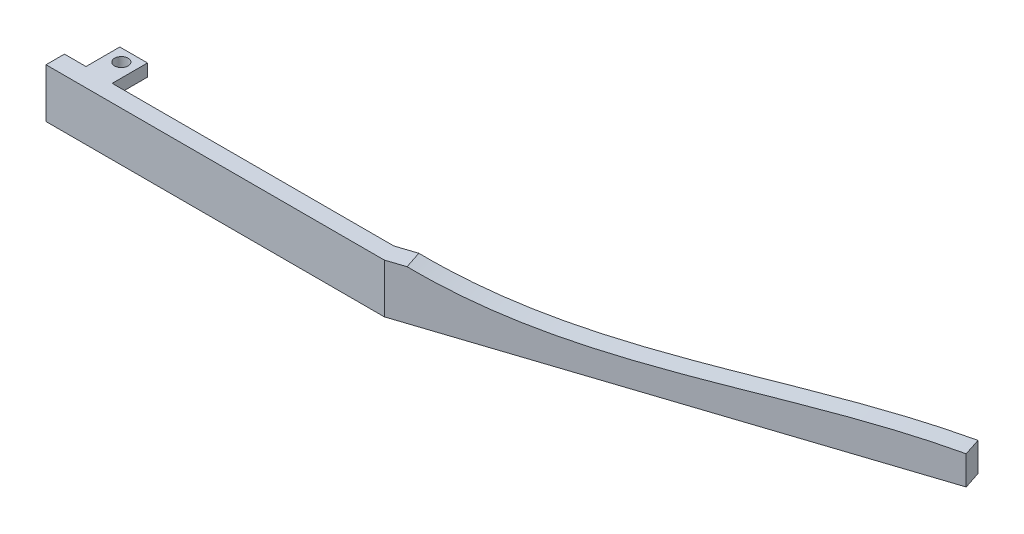
ISO-10303-21;
HEADER;
FILE_DESCRIPTION(('STEP AP214'),'2;1');
FILE_NAME('part.step','',(''),(''),'','','');
FILE_SCHEMA(('AUTOMOTIVE_DESIGN { 1 0 10303 214 1 1 1 1 }'));
ENDSEC;
DATA;
#1=APPLICATION_CONTEXT('core data for automotive mechanical design processes');
#2=APPLICATION_PROTOCOL_DEFINITION('international standard','automotive_design',2000,#1);
#3=PRODUCT_CONTEXT('',#1,'mechanical');
#4=PRODUCT('Part','Part','',(#3));
#5=PRODUCT_RELATED_PRODUCT_CATEGORY('part','',(#4));
#6=PRODUCT_DEFINITION_FORMATION('','',#4);
#7=PRODUCT_DEFINITION_CONTEXT('part definition',#1,'design');
#8=PRODUCT_DEFINITION('design','',#6,#7);
#9=PRODUCT_DEFINITION_SHAPE('','',#8);
#10=(LENGTH_UNIT() NAMED_UNIT(*) SI_UNIT(.MILLI.,.METRE.));
#11=(NAMED_UNIT(*) PLANE_ANGLE_UNIT() SI_UNIT($,.RADIAN.));
#12=(NAMED_UNIT(*) SI_UNIT($,.STERADIAN.) SOLID_ANGLE_UNIT());
#13=UNCERTAINTY_MEASURE_WITH_UNIT(LENGTH_MEASURE(1.E-05),#10,'distance_accuracy_value','');
#14=(GEOMETRIC_REPRESENTATION_CONTEXT(3) GLOBAL_UNCERTAINTY_ASSIGNED_CONTEXT((#13)) GLOBAL_UNIT_ASSIGNED_CONTEXT((#10,
#11,#12)) REPRESENTATION_CONTEXT('',''));
#15=CARTESIAN_POINT('',(0.,0.,0.));
#16=DIRECTION('',(0.,0.,1.));
#17=DIRECTION('',(1.,0.,0.));
#18=AXIS2_PLACEMENT_3D('',#15,#16,#17);
#19=CARTESIAN_POINT('',(0.,8.,0.));
#20=DIRECTION('',(0.,1.,0.));
#21=DIRECTION('',(0.,0.,1.));
#22=AXIS2_PLACEMENT_3D('',#19,#20,#21);
#23=PLANE('',#22);
#24=CARTESIAN_POINT('',(5.75,8.,-6.5));
#25=DIRECTION('',(0.,1.,0.));
#26=DIRECTION('',(0.,0.,1.));
#27=AXIS2_PLACEMENT_3D('',#24,#25,#26);
#28=CIRCLE('',#27,1.1);
#29=CARTESIAN_POINT('',(5.75,8.,-5.4));
#30=VERTEX_POINT('',#29);
#31=EDGE_CURVE('E348',#30,#30,#28,.T.);
#32=ORIENTED_EDGE('',*,*,#31,.F.);
#33=EDGE_LOOP('',(#32));
#34=FACE_BOUND('',#33,.T.);
#35=DIRECTION('',(0.950313133540324,0.,-0.311295596211657));
#36=VECTOR('',#35,1.);
#37=CARTESIAN_POINT('',(55.,8.,0.));
#38=LINE('',#37,#36);
#39=CARTESIAN_POINT('',(55.,8.,0.));
#40=VERTEX_POINT('',#39);
#41=CARTESIAN_POINT('',(57.7917988173368,8.,-0.914514012984538));
#42=VERTEX_POINT('',#41);
#43=EDGE_CURVE('E264',#40,#42,#38,.T.);
#44=ORIENTED_EDGE('',*,*,#43,.T.);
#45=DIRECTION('',(-0.311295596211657,0.,-0.950313133540324));
#46=VECTOR('',#45,1.);
#47=CARTESIAN_POINT('',(116.906435518501,8.,179.548738038244));
#48=LINE('',#47,#46);
#49=CARTESIAN_POINT('',(56.8579120287019,8.,-3.76545341360549));
#50=VERTEX_POINT('',#49);
#51=EDGE_CURVE('E56',#42,#50,#48,.T.);
#52=ORIENTED_EDGE('',*,*,#51,.T.);
#53=DIRECTION('',(-0.950313133540324,0.,0.311295596211657));
#54=VECTOR('',#53,1.);
#55=CARTESIAN_POINT('',(125.339598226889,8.,-26.1981091164952));
#56=LINE('',#55,#54);
#57=CARTESIAN_POINT('',(53.7936472263363,8.,-2.76168728122646));
#58=VERTEX_POINT('',#57);
#59=EDGE_CURVE('E166',#50,#58,#56,.T.);
#60=ORIENTED_EDGE('',*,*,#59,.T.);
#61=DIRECTION('',(-1.,0.,0.));
#62=VECTOR('',#61,1.);
#63=CARTESIAN_POINT('',(53.7936472263363,8.,-2.76168728122646));
#64=LINE('',#63,#62);
#65=CARTESIAN_POINT('',(8.,8.,-2.76168728122645));
#66=VERTEX_POINT('',#65);
#67=EDGE_CURVE('E365',#58,#66,#64,.T.);
#68=ORIENTED_EDGE('',*,*,#67,.T.);
#69=DIRECTION('',(0.,0.,-1.));
#70=VECTOR('',#69,1.);
#71=CARTESIAN_POINT('',(8.,8.,-2.76168728122645));
#72=LINE('',#71,#70);
#73=CARTESIAN_POINT('',(8.,8.,-8.5));
#74=VERTEX_POINT('',#73);
#75=EDGE_CURVE('E368',#66,#74,#72,.T.);
#76=ORIENTED_EDGE('',*,*,#75,.T.);
#77=DIRECTION('',(-1.,0.,0.));
#78=VECTOR('',#77,1.);
#79=CARTESIAN_POINT('',(8.,8.,-8.5));
#80=LINE('',#79,#78);
#81=CARTESIAN_POINT('',(3.5,8.,-8.5));
#82=VERTEX_POINT('',#81);
#83=EDGE_CURVE('E371',#74,#82,#80,.T.);
#84=ORIENTED_EDGE('',*,*,#83,.T.);
#85=DIRECTION('',(0.,0.,1.));
#86=VECTOR('',#85,1.);
#87=CARTESIAN_POINT('',(3.5,8.,-8.5));
#88=LINE('',#87,#86);
#89=CARTESIAN_POINT('',(3.5,8.,-3.));
#90=VERTEX_POINT('',#89);
#91=EDGE_CURVE('E374',#82,#90,#88,.T.);
#92=ORIENTED_EDGE('',*,*,#91,.T.);
#93=DIRECTION('',(-1.,0.,0.));
#94=VECTOR('',#93,1.);
#95=CARTESIAN_POINT('',(3.5,8.,-3.));
#96=LINE('',#95,#94);
#97=CARTESIAN_POINT('',(0.,8.,-3.));
#98=VERTEX_POINT('',#97);
#99=EDGE_CURVE('E300',#90,#98,#96,.T.);
#100=ORIENTED_EDGE('',*,*,#99,.T.);
#101=DIRECTION('',(0.,0.,1.));
#102=VECTOR('',#101,1.);
#103=CARTESIAN_POINT('',(0.,8.,-3.));
#104=LINE('',#103,#102);
#105=CARTESIAN_POINT('',(0.,8.,0.));
#106=VERTEX_POINT('',#105);
#107=EDGE_CURVE('E294',#98,#106,#104,.T.);
#108=ORIENTED_EDGE('',*,*,#107,.T.);
#109=DIRECTION('',(1.,0.,0.));
#110=VECTOR('',#109,1.);
#111=CARTESIAN_POINT('',(0.,8.,0.));
#112=LINE('',#111,#110);
#113=EDGE_CURVE('E358',#106,#40,#112,.T.);
#114=ORIENTED_EDGE('',*,*,#113,.T.);
#115=EDGE_LOOP('',(#44,#52,#60,#68,#76,#84,#92,#100,#108,#114));
#116=FACE_BOUND('',#115,.T.);
#117=ADVANCED_FACE('F38',(#34,#116),#23,.T.);
#118=CARTESIAN_POINT('',(55.,8.,0.));
#119=DIRECTION('',(-0.311295596211657,0.,-0.950313133540324));
#120=DIRECTION('',(-0.950313133540324,0.,0.311295596211657));
#121=AXIS2_PLACEMENT_3D('',#118,#119,#120);
#122=PLANE('',#121);
#123=CARTESIAN_POINT('',(126.273485015524,4.68039506314293,-23.3471697158743));
#124=CARTESIAN_POINT('',(103.559690950828,6.60305618045738,-15.9067757909191));
#125=CARTESIAN_POINT('',(79.844883191052,0.426209565425302,-8.13847820555177));
#126=CARTESIAN_POINT('',(57.7917988173368,8.,-0.914514012984563));
#127=B_SPLINE_CURVE_WITH_KNOTS('',3,(#123,#124,#125,#126),.UNSPECIFIED.,.F.,.F.,(4,4),(0.,1.),.UNSPECIFIED.);
#128=CARTESIAN_POINT('',(126.273485015524,4.68039506314293,-23.3471697158742));
#129=VERTEX_POINT('',#128);
#130=EDGE_CURVE('E64',#42,#129,#127,.F.);
#131=ORIENTED_EDGE('',*,*,#130,.F.);
#132=ORIENTED_EDGE('',*,*,#43,.F.);
#133=DIRECTION('',(0.,-1.,0.));
#134=VECTOR('',#133,1.);
#135=CARTESIAN_POINT('',(55.,8.,0.));
#136=LINE('',#135,#134);
#137=CARTESIAN_POINT('',(55.,0.,0.));
#138=VERTEX_POINT('',#137);
#139=EDGE_CURVE('E48',#40,#138,#136,.T.);
#140=ORIENTED_EDGE('',*,*,#139,.T.);
#141=DIRECTION('',(0.950313133540324,0.,-0.311295596211657));
#142=VECTOR('',#141,1.);
#143=CARTESIAN_POINT('',(55.,0.,0.));
#144=LINE('',#143,#142);
#145=CARTESIAN_POINT('',(126.273485015524,0.,-23.3471697158742));
#146=VERTEX_POINT('',#145);
#147=EDGE_CURVE('E260',#138,#146,#144,.T.);
#148=ORIENTED_EDGE('',*,*,#147,.T.);
#149=DIRECTION('',(0.,-1.,0.));
#150=VECTOR('',#149,1.);
#151=CARTESIAN_POINT('',(126.273485015524,8.,-23.3471697158742));
#152=LINE('',#151,#150);
#153=EDGE_CURVE('E159',#129,#146,#152,.T.);
#154=ORIENTED_EDGE('',*,*,#153,.F.);
#155=EDGE_LOOP('',(#131,#132,#140,#148,#154));
#156=FACE_BOUND('',#155,.T.);
#157=ADVANCED_FACE('F213',(#156),#122,.F.);
#158=CARTESIAN_POINT('',(126.273485015524,8.,-23.3471697158742));
#159=DIRECTION('',(-0.950313133540325,0.,0.311295596211652));
#160=DIRECTION('',(0.311295596211652,0.,0.950313133540325));
#161=AXIS2_PLACEMENT_3D('',#158,#159,#160);
#162=PLANE('',#161);
#163=DIRECTION('',(-0.311295596211657,0.,-0.950313133540324));
#164=VECTOR('',#163,1.);
#165=CARTESIAN_POINT('',(185.388121716689,4.68039506314293,157.116082335354));
#166=LINE('',#165,#164);
#167=CARTESIAN_POINT('',(125.339598226889,4.68039506314293,-26.1981091164952));
#168=VERTEX_POINT('',#167);
#169=EDGE_CURVE('E153',#129,#168,#166,.T.);
#170=ORIENTED_EDGE('',*,*,#169,.F.);
#171=ORIENTED_EDGE('',*,*,#153,.T.);
#172=DIRECTION('',(-0.311295596211652,0.,-0.950313133540325));
#173=VECTOR('',#172,1.);
#174=CARTESIAN_POINT('',(126.273485015524,0.,-23.3471697158742));
#175=LINE('',#174,#173);
#176=CARTESIAN_POINT('',(125.339598226889,0.,-26.1981091164952));
#177=VERTEX_POINT('',#176);
#178=EDGE_CURVE('E155',#146,#177,#175,.T.);
#179=ORIENTED_EDGE('',*,*,#178,.T.);
#180=DIRECTION('',(0.,-1.,0.));
#181=VECTOR('',#180,1.);
#182=CARTESIAN_POINT('',(125.339598226889,8.,-26.1981091164952));
#183=LINE('',#182,#181);
#184=EDGE_CURVE('E149',#168,#177,#183,.T.);
#185=ORIENTED_EDGE('',*,*,#184,.F.);
#186=EDGE_LOOP('',(#170,#171,#179,#185));
#187=FACE_BOUND('',#186,.T.);
#188=ADVANCED_FACE('F151',(#187),#162,.F.);
#189=CARTESIAN_POINT('',(8.,8.,-8.5));
#190=DIRECTION('',(0.,0.,1.));
#191=DIRECTION('',(1.,0.,0.));
#192=AXIS2_PLACEMENT_3D('',#189,#190,#191);
#193=PLANE('',#192);
#194=DIRECTION('',(0.,-1.,0.));
#195=VECTOR('',#194,1.);
#196=CARTESIAN_POINT('',(8.,8.,-8.5));
#197=LINE('',#196,#195);
#198=CARTESIAN_POINT('',(8.,6.,-8.5));
#199=VERTEX_POINT('',#198);
#200=EDGE_CURVE('E310',#74,#199,#197,.T.);
#201=ORIENTED_EDGE('',*,*,#200,.T.);
#202=DIRECTION('',(1.,0.,0.));
#203=VECTOR('',#202,1.);
#204=CARTESIAN_POINT('',(8.,6.,-8.5));
#205=LINE('',#204,#203);
#206=CARTESIAN_POINT('',(3.5,6.,-8.5));
#207=VERTEX_POINT('',#206);
#208=EDGE_CURVE('E176',#207,#199,#205,.T.);
#209=ORIENTED_EDGE('',*,*,#208,.F.);
#210=DIRECTION('',(0.,-1.,0.));
#211=VECTOR('',#210,1.);
#212=CARTESIAN_POINT('',(3.5,8.,-8.5));
#213=LINE('',#212,#211);
#214=EDGE_CURVE('E305',#82,#207,#213,.T.);
#215=ORIENTED_EDGE('',*,*,#214,.F.);
#216=ORIENTED_EDGE('',*,*,#83,.F.);
#217=EDGE_LOOP('',(#201,#209,#215,#216));
#218=FACE_BOUND('',#217,.T.);
#219=ADVANCED_FACE('F231',(#218),#193,.F.);
#220=CARTESIAN_POINT('',(5.75,8.,-6.5));
#221=DIRECTION('',(0.,-1.,0.));
#222=DIRECTION('',(0.,0.,-1.));
#223=AXIS2_PLACEMENT_3D('',#220,#221,#222);
#224=CYLINDRICAL_SURFACE('',#223,1.1);
#225=CARTESIAN_POINT('',(5.75,6.,-6.5));
#226=DIRECTION('',(0.,1.,0.));
#227=DIRECTION('',(0.,0.,1.));
#228=AXIS2_PLACEMENT_3D('',#225,#226,#227);
#229=CIRCLE('',#228,1.1);
#230=CARTESIAN_POINT('',(5.75,6.,-5.4));
#231=VERTEX_POINT('',#230);
#232=EDGE_CURVE('E42',#231,#231,#229,.T.);
#233=ORIENTED_EDGE('',*,*,#232,.F.);
#234=EDGE_LOOP('',(#233));
#235=FACE_BOUND('',#234,.T.);
#236=ORIENTED_EDGE('',*,*,#31,.T.);
#237=EDGE_LOOP('',(#236));
#238=FACE_BOUND('',#237,.T.);
#239=ADVANCED_FACE('F210',(#235,#238),#224,.F.);
#240=CARTESIAN_POINT('',(0.,0.,0.));
#241=DIRECTION('',(0.,1.,0.));
#242=DIRECTION('',(0.,0.,1.));
#243=AXIS2_PLACEMENT_3D('',#240,#241,#242);
#244=PLANE('',#243);
#245=DIRECTION('',(0.,0.,1.));
#246=VECTOR('',#245,1.);
#247=CARTESIAN_POINT('',(0.,0.,-3.));
#248=LINE('',#247,#246);
#249=CARTESIAN_POINT('',(0.,0.,-3.));
#250=VERTEX_POINT('',#249);
#251=CARTESIAN_POINT('',(0.,0.,0.));
#252=VERTEX_POINT('',#251);
#253=EDGE_CURVE('E261',#250,#252,#248,.T.);
#254=ORIENTED_EDGE('',*,*,#253,.F.);
#255=DIRECTION('',(-1.,0.,0.));
#256=VECTOR('',#255,1.);
#257=CARTESIAN_POINT('',(3.5,0.,-3.));
#258=LINE('',#257,#256);
#259=CARTESIAN_POINT('',(3.5,0.,-3.));
#260=VERTEX_POINT('',#259);
#261=EDGE_CURVE('E291',#260,#250,#258,.T.);
#262=ORIENTED_EDGE('',*,*,#261,.F.);
#263=DIRECTION('',(0.,0.,1.));
#264=VECTOR('',#263,1.);
#265=CARTESIAN_POINT('',(3.5,0.,-8.5));
#266=LINE('',#265,#264);
#267=CARTESIAN_POINT('',(3.5,0.,-8.5));
#268=VERTEX_POINT('',#267);
#269=EDGE_CURVE('E288',#268,#260,#266,.T.);
#270=ORIENTED_EDGE('',*,*,#269,.F.);
#271=DIRECTION('',(-1.,0.,0.));
#272=VECTOR('',#271,1.);
#273=CARTESIAN_POINT('',(8.,0.,-8.5));
#274=LINE('',#273,#272);
#275=CARTESIAN_POINT('',(8.,0.,-8.5));
#276=VERTEX_POINT('',#275);
#277=EDGE_CURVE('E284',#276,#268,#274,.T.);
#278=ORIENTED_EDGE('',*,*,#277,.F.);
#279=DIRECTION('',(0.,0.,-1.));
#280=VECTOR('',#279,1.);
#281=CARTESIAN_POINT('',(8.,0.,-2.76168728122645));
#282=LINE('',#281,#280);
#283=CARTESIAN_POINT('',(8.,0.,-2.76168728122645));
#284=VERTEX_POINT('',#283);
#285=EDGE_CURVE('E280',#284,#276,#282,.T.);
#286=ORIENTED_EDGE('',*,*,#285,.F.);
#287=DIRECTION('',(-1.,0.,0.));
#288=VECTOR('',#287,1.);
#289=CARTESIAN_POINT('',(53.7936472263363,0.,-2.76168728122646));
#290=LINE('',#289,#288);
#291=CARTESIAN_POINT('',(53.7936472263363,0.,-2.76168728122646));
#292=VERTEX_POINT('',#291);
#293=EDGE_CURVE('E277',#292,#284,#290,.T.);
#294=ORIENTED_EDGE('',*,*,#293,.F.);
#295=DIRECTION('',(-0.950313133540324,0.,0.311295596211657));
#296=VECTOR('',#295,1.);
#297=CARTESIAN_POINT('',(125.339598226889,0.,-26.1981091164952));
#298=LINE('',#297,#296);
#299=EDGE_CURVE('E271',#177,#292,#298,.T.);
#300=ORIENTED_EDGE('',*,*,#299,.F.);
#301=ORIENTED_EDGE('',*,*,#178,.F.);
#302=ORIENTED_EDGE('',*,*,#147,.F.);
#303=DIRECTION('',(1.,0.,0.));
#304=VECTOR('',#303,1.);
#305=CARTESIAN_POINT('',(0.,0.,0.));
#306=LINE('',#305,#304);
#307=EDGE_CURVE('E253',#252,#138,#306,.T.);
#308=ORIENTED_EDGE('',*,*,#307,.F.);
#309=EDGE_LOOP('',(#254,#262,#270,#278,#286,#294,#300,#301,#302,#308));
#310=FACE_BOUND('',#309,.T.);
#311=CARTESIAN_POINT('',(5.75,0.,-6.5));
#312=DIRECTION('',(0.,1.,0.));
#313=DIRECTION('',(0.,0.,1.));
#314=AXIS2_PLACEMENT_3D('',#311,#312,#313);
#315=CIRCLE('',#314,1.1);
#316=CARTESIAN_POINT('',(5.75,0.,-5.4));
#317=VERTEX_POINT('',#316);
#318=EDGE_CURVE('E330',#317,#317,#315,.T.);
#319=ORIENTED_EDGE('',*,*,#318,.T.);
#320=EDGE_LOOP('',(#319));
#321=FACE_BOUND('',#320,.T.);
#322=ADVANCED_FACE('F215',(#310,#321),#244,.F.);
#323=CARTESIAN_POINT('',(0.,8.,-3.));
#324=DIRECTION('',(1.,0.,0.));
#325=DIRECTION('',(0.,0.,-1.));
#326=AXIS2_PLACEMENT_3D('',#323,#324,#325);
#327=PLANE('',#326);
#328=ORIENTED_EDGE('',*,*,#253,.T.);
#329=DIRECTION('',(0.,-1.,0.));
#330=VECTOR('',#329,1.);
#331=CARTESIAN_POINT('',(0.,8.,0.));
#332=LINE('',#331,#330);
#333=EDGE_CURVE('E11',#106,#252,#332,.T.);
#334=ORIENTED_EDGE('',*,*,#333,.F.);
#335=ORIENTED_EDGE('',*,*,#107,.F.);
#336=DIRECTION('',(0.,-1.,0.));
#337=VECTOR('',#336,1.);
#338=CARTESIAN_POINT('',(0.,8.,-3.));
#339=LINE('',#338,#337);
#340=EDGE_CURVE('E295',#98,#250,#339,.T.);
#341=ORIENTED_EDGE('',*,*,#340,.T.);
#342=EDGE_LOOP('',(#328,#334,#335,#341));
#343=FACE_BOUND('',#342,.T.);
#344=ADVANCED_FACE('F40',(#343),#327,.F.);
#345=CARTESIAN_POINT('',(0.,8.,0.));
#346=DIRECTION('',(0.,0.,-1.));
#347=DIRECTION('',(-1.,0.,0.));
#348=AXIS2_PLACEMENT_3D('',#345,#346,#347);
#349=PLANE('',#348);
#350=ORIENTED_EDGE('',*,*,#307,.T.);
#351=ORIENTED_EDGE('',*,*,#139,.F.);
#352=ORIENTED_EDGE('',*,*,#113,.F.);
#353=ORIENTED_EDGE('',*,*,#333,.T.);
#354=EDGE_LOOP('',(#350,#351,#352,#353));
#355=FACE_BOUND('',#354,.T.);
#356=ADVANCED_FACE('F241',(#355),#349,.F.);
#357=CARTESIAN_POINT('',(125.339598226889,8.,-26.1981091164952));
#358=DIRECTION('',(0.311295596211657,0.,0.950313133540324));
#359=DIRECTION('',(0.950313133540324,0.,-0.311295596211657));
#360=AXIS2_PLACEMENT_3D('',#357,#358,#359);
#361=PLANE('',#360);
#362=ORIENTED_EDGE('',*,*,#59,.F.);
#363=CARTESIAN_POINT('',(125.339598226889,4.68039506314293,-26.1981091164953));
#364=CARTESIAN_POINT('',(102.625804162193,6.60305618045738,-18.7577151915401));
#365=CARTESIAN_POINT('',(78.910996402417,0.426209565425302,-10.9894176061728));
#366=CARTESIAN_POINT('',(56.8579120287019,8.,-3.76545341360554));
#367=B_SPLINE_CURVE_WITH_KNOTS('',3,(#363,#364,#365,#366),.UNSPECIFIED.,.F.,.F.,(4,4),(0.,1.),.UNSPECIFIED.);
#368=EDGE_CURVE('E163',#50,#168,#367,.F.);
#369=ORIENTED_EDGE('',*,*,#368,.T.);
#370=ORIENTED_EDGE('',*,*,#184,.T.);
#371=ORIENTED_EDGE('',*,*,#299,.T.);
#372=DIRECTION('',(0.,-1.,0.));
#373=VECTOR('',#372,1.);
#374=CARTESIAN_POINT('',(53.7936472263363,8.,-2.76168728122646));
#375=LINE('',#374,#373);
#376=EDGE_CURVE('E160',#58,#292,#375,.T.);
#377=ORIENTED_EDGE('',*,*,#376,.F.);
#378=EDGE_LOOP('',(#362,#369,#370,#371,#377));
#379=FACE_BOUND('',#378,.T.);
#380=ADVANCED_FACE('F164',(#379),#361,.F.);
#381=CARTESIAN_POINT('',(53.7936472263363,8.,-2.76168728122646));
#382=DIRECTION('',(0.,0.,1.));
#383=DIRECTION('',(1.,0.,0.));
#384=AXIS2_PLACEMENT_3D('',#381,#382,#383);
#385=PLANE('',#384);
#386=ORIENTED_EDGE('',*,*,#293,.T.);
#387=DIRECTION('',(0.,-1.,0.));
#388=VECTOR('',#387,1.);
#389=CARTESIAN_POINT('',(8.,8.,-2.76168728122645));
#390=LINE('',#389,#388);
#391=EDGE_CURVE('E314',#66,#284,#390,.T.);
#392=ORIENTED_EDGE('',*,*,#391,.F.);
#393=ORIENTED_EDGE('',*,*,#67,.F.);
#394=ORIENTED_EDGE('',*,*,#376,.T.);
#395=EDGE_LOOP('',(#386,#392,#393,#394));
#396=FACE_BOUND('',#395,.T.);
#397=ADVANCED_FACE('F234',(#396),#385,.F.);
#398=CARTESIAN_POINT('',(8.,8.,-2.76168728122645));
#399=DIRECTION('',(-1.,0.,0.));
#400=DIRECTION('',(0.,0.,1.));
#401=AXIS2_PLACEMENT_3D('',#398,#399,#400);
#402=PLANE('',#401);
#403=DIRECTION('',(0.,-1.,0.));
#404=VECTOR('',#403,1.);
#405=CARTESIAN_POINT('',(8.,6.,-3.5));
#406=LINE('',#405,#404);
#407=CARTESIAN_POINT('',(8.,6.,-3.5));
#408=VERTEX_POINT('',#407);
#409=CARTESIAN_POINT('',(8.,2.,-3.5));
#410=VERTEX_POINT('',#409);
#411=EDGE_CURVE('E185',#408,#410,#406,.T.);
#412=ORIENTED_EDGE('',*,*,#411,.F.);
#413=DIRECTION('',(0.,0.,-1.));
#414=VECTOR('',#413,1.);
#415=CARTESIAN_POINT('',(8.,6.,-3.5));
#416=LINE('',#415,#414);
#417=EDGE_CURVE('E325',#408,#199,#416,.T.);
#418=ORIENTED_EDGE('',*,*,#417,.T.);
#419=ORIENTED_EDGE('',*,*,#200,.F.);
#420=ORIENTED_EDGE('',*,*,#75,.F.);
#421=ORIENTED_EDGE('',*,*,#391,.T.);
#422=ORIENTED_EDGE('',*,*,#285,.T.);
#423=CARTESIAN_POINT('',(8.,2.,-8.5));
#424=VERTEX_POINT('',#423);
#425=EDGE_CURVE('E309',#424,#276,#197,.T.);
#426=ORIENTED_EDGE('',*,*,#425,.F.);
#427=DIRECTION('',(0.,0.,-1.));
#428=VECTOR('',#427,1.);
#429=CARTESIAN_POINT('',(8.,2.,-3.5));
#430=LINE('',#429,#428);
#431=EDGE_CURVE('E344',#410,#424,#430,.T.);
#432=ORIENTED_EDGE('',*,*,#431,.F.);
#433=EDGE_LOOP('',(#412,#418,#419,#420,#421,#422,#426,#432));
#434=FACE_BOUND('',#433,.T.);
#435=ADVANCED_FACE('F229',(#434),#402,.F.);
#436=CARTESIAN_POINT('',(3.5,2.,-8.5));
#437=VERTEX_POINT('',#436);
#438=EDGE_CURVE('E304',#437,#268,#213,.T.);
#439=ORIENTED_EDGE('',*,*,#438,.F.);
#440=DIRECTION('',(-1.,0.,0.));
#441=VECTOR('',#440,1.);
#442=CARTESIAN_POINT('',(8.,2.,-8.5));
#443=LINE('',#442,#441);
#444=EDGE_CURVE('E172',#424,#437,#443,.T.);
#445=ORIENTED_EDGE('',*,*,#444,.F.);
#446=ORIENTED_EDGE('',*,*,#425,.T.);
#447=ORIENTED_EDGE('',*,*,#277,.T.);
#448=EDGE_LOOP('',(#439,#445,#446,#447));
#449=FACE_BOUND('',#448,.T.);
#450=ADVANCED_FACE('F225',(#449),#193,.F.);
#451=CARTESIAN_POINT('',(3.5,8.,-8.5));
#452=DIRECTION('',(1.,0.,0.));
#453=DIRECTION('',(0.,0.,-1.));
#454=AXIS2_PLACEMENT_3D('',#451,#452,#453);
#455=PLANE('',#454);
#456=ORIENTED_EDGE('',*,*,#214,.T.);
#457=DIRECTION('',(0.,0.,-1.));
#458=VECTOR('',#457,1.);
#459=CARTESIAN_POINT('',(3.5,6.,-3.5));
#460=LINE('',#459,#458);
#461=CARTESIAN_POINT('',(3.5,6.,-3.5));
#462=VERTEX_POINT('',#461);
#463=EDGE_CURVE('E332',#462,#207,#460,.T.);
#464=ORIENTED_EDGE('',*,*,#463,.F.);
#465=DIRECTION('',(0.,1.,0.));
#466=VECTOR('',#465,1.);
#467=CARTESIAN_POINT('',(3.5,6.,-3.5));
#468=LINE('',#467,#466);
#469=CARTESIAN_POINT('',(3.5,2.,-3.5));
#470=VERTEX_POINT('',#469);
#471=EDGE_CURVE('E404',#470,#462,#468,.T.);
#472=ORIENTED_EDGE('',*,*,#471,.F.);
#473=DIRECTION('',(0.,0.,-1.));
#474=VECTOR('',#473,1.);
#475=CARTESIAN_POINT('',(3.5,2.,-3.5));
#476=LINE('',#475,#474);
#477=EDGE_CURVE('E337',#470,#437,#476,.T.);
#478=ORIENTED_EDGE('',*,*,#477,.T.);
#479=ORIENTED_EDGE('',*,*,#438,.T.);
#480=ORIENTED_EDGE('',*,*,#269,.T.);
#481=DIRECTION('',(0.,-1.,0.));
#482=VECTOR('',#481,1.);
#483=CARTESIAN_POINT('',(3.5,8.,-3.));
#484=LINE('',#483,#482);
#485=EDGE_CURVE('E299',#90,#260,#484,.T.);
#486=ORIENTED_EDGE('',*,*,#485,.F.);
#487=ORIENTED_EDGE('',*,*,#91,.F.);
#488=EDGE_LOOP('',(#456,#464,#472,#478,#479,#480,#486,#487));
#489=FACE_BOUND('',#488,.T.);
#490=ADVANCED_FACE('F221',(#489),#455,.F.);
#491=CARTESIAN_POINT('',(3.5,8.,-3.));
#492=DIRECTION('',(0.,0.,1.));
#493=DIRECTION('',(1.,0.,0.));
#494=AXIS2_PLACEMENT_3D('',#491,#492,#493);
#495=PLANE('',#494);
#496=ORIENTED_EDGE('',*,*,#261,.T.);
#497=ORIENTED_EDGE('',*,*,#340,.F.);
#498=ORIENTED_EDGE('',*,*,#99,.F.);
#499=ORIENTED_EDGE('',*,*,#485,.T.);
#500=EDGE_LOOP('',(#496,#497,#498,#499));
#501=FACE_BOUND('',#500,.T.);
#502=ADVANCED_FACE('F208',(#501),#495,.F.);
#503=CARTESIAN_POINT('',(5.75,2.,-6.5));
#504=DIRECTION('',(0.,-1.,0.));
#505=DIRECTION('',(0.,0.,-1.));
#506=AXIS2_PLACEMENT_3D('',#503,#504,#505);
#507=CIRCLE('',#506,1.1);
#508=CARTESIAN_POINT('',(5.75,2.,-7.6));
#509=VERTEX_POINT('',#508);
#510=EDGE_CURVE('E322',#509,#509,#507,.T.);
#511=ORIENTED_EDGE('',*,*,#510,.F.);
#512=EDGE_LOOP('',(#511));
#513=FACE_BOUND('',#512,.T.);
#514=ORIENTED_EDGE('',*,*,#318,.F.);
#515=EDGE_LOOP('',(#514));
#516=FACE_BOUND('',#515,.T.);
#517=ADVANCED_FACE('F201',(#513,#516),#224,.F.);
#518=CARTESIAN_POINT('',(8.,6.,-3.5));
#519=DIRECTION('',(0.,1.,0.));
#520=DIRECTION('',(0.,0.,1.));
#521=AXIS2_PLACEMENT_3D('',#518,#519,#520);
#522=PLANE('',#521);
#523=ORIENTED_EDGE('',*,*,#232,.T.);
#524=EDGE_LOOP('',(#523));
#525=FACE_BOUND('',#524,.T.);
#526=ORIENTED_EDGE('',*,*,#208,.T.);
#527=ORIENTED_EDGE('',*,*,#417,.F.);
#528=DIRECTION('',(1.,0.,0.));
#529=VECTOR('',#528,1.);
#530=CARTESIAN_POINT('',(8.,6.,-3.5));
#531=LINE('',#530,#529);
#532=EDGE_CURVE('E347',#462,#408,#531,.T.);
#533=ORIENTED_EDGE('',*,*,#532,.F.);
#534=ORIENTED_EDGE('',*,*,#463,.T.);
#535=EDGE_LOOP('',(#526,#527,#533,#534));
#536=FACE_BOUND('',#535,.T.);
#537=ADVANCED_FACE('F198',(#525,#536),#522,.F.);
#538=CARTESIAN_POINT('',(8.,2.,-3.5));
#539=DIRECTION('',(0.,-1.,0.));
#540=DIRECTION('',(0.,0.,-1.));
#541=AXIS2_PLACEMENT_3D('',#538,#539,#540);
#542=PLANE('',#541);
#543=ORIENTED_EDGE('',*,*,#510,.T.);
#544=EDGE_LOOP('',(#543));
#545=FACE_BOUND('',#544,.T.);
#546=ORIENTED_EDGE('',*,*,#444,.T.);
#547=ORIENTED_EDGE('',*,*,#477,.F.);
#548=DIRECTION('',(-1.,0.,0.));
#549=VECTOR('',#548,1.);
#550=CARTESIAN_POINT('',(8.,2.,-3.5));
#551=LINE('',#550,#549);
#552=EDGE_CURVE('E412',#410,#470,#551,.T.);
#553=ORIENTED_EDGE('',*,*,#552,.F.);
#554=ORIENTED_EDGE('',*,*,#431,.T.);
#555=EDGE_LOOP('',(#546,#547,#553,#554));
#556=FACE_BOUND('',#555,.T.);
#557=ADVANCED_FACE('F196',(#545,#556),#542,.F.);
#558=CARTESIAN_POINT('',(0.,0.,-3.5));
#559=DIRECTION('',(0.,0.,-1.));
#560=DIRECTION('',(-1.,0.,0.));
#561=AXIS2_PLACEMENT_3D('',#558,#559,#560);
#562=PLANE('',#561);
#563=ORIENTED_EDGE('',*,*,#411,.T.);
#564=ORIENTED_EDGE('',*,*,#552,.T.);
#565=ORIENTED_EDGE('',*,*,#471,.T.);
#566=ORIENTED_EDGE('',*,*,#532,.T.);
#567=EDGE_LOOP('',(#563,#564,#565,#566));
#568=FACE_BOUND('',#567,.T.);
#569=ADVANCED_FACE('F193',(#568),#562,.T.);
#570=CARTESIAN_POINT('',(185.388121716689,4.68039506314293,157.116082335354));
#571=CARTESIAN_POINT('',(162.674327651992,6.60305618045738,164.556476260309));
#572=CARTESIAN_POINT('',(138.959519892217,0.426209565425302,172.324773845676));
#573=CARTESIAN_POINT('',(116.906435518501,8.,179.548738038244));
#574=B_SPLINE_CURVE_WITH_KNOTS('',3,(#570,#571,#572,#573),.UNSPECIFIED.,.F.,.F.,(4,4),(0.,1.),.UNSPECIFIED.);
#575=DIRECTION('',(-0.311295596211657,0.,-0.950313133540324));
#576=VECTOR('',#575,1.);
#577=SURFACE_OF_LINEAR_EXTRUSION('',#574,#576);
#578=ORIENTED_EDGE('',*,*,#130,.T.);
#579=ORIENTED_EDGE('',*,*,#169,.T.);
#580=ORIENTED_EDGE('',*,*,#368,.F.);
#581=ORIENTED_EDGE('',*,*,#51,.F.);
#582=EDGE_LOOP('',(#578,#579,#580,#581));
#583=FACE_BOUND('',#582,.T.);
#584=ADVANCED_FACE('F170',(#583),#577,.F.);
#585=CLOSED_SHELL('',(#117,#157,#188,#219,#239,#322,#344,#356,#380,#397,#435,#450,#490,#502,
#517,#537,#557,#569,#584));
#586=MANIFOLD_SOLID_BREP('B2',#585);
#587=ADVANCED_BREP_SHAPE_REPRESENTATION('',(#18,#586),#14);
#588=SHAPE_DEFINITION_REPRESENTATION(#9,#587);
ENDSEC;
END-ISO-10303-21;
